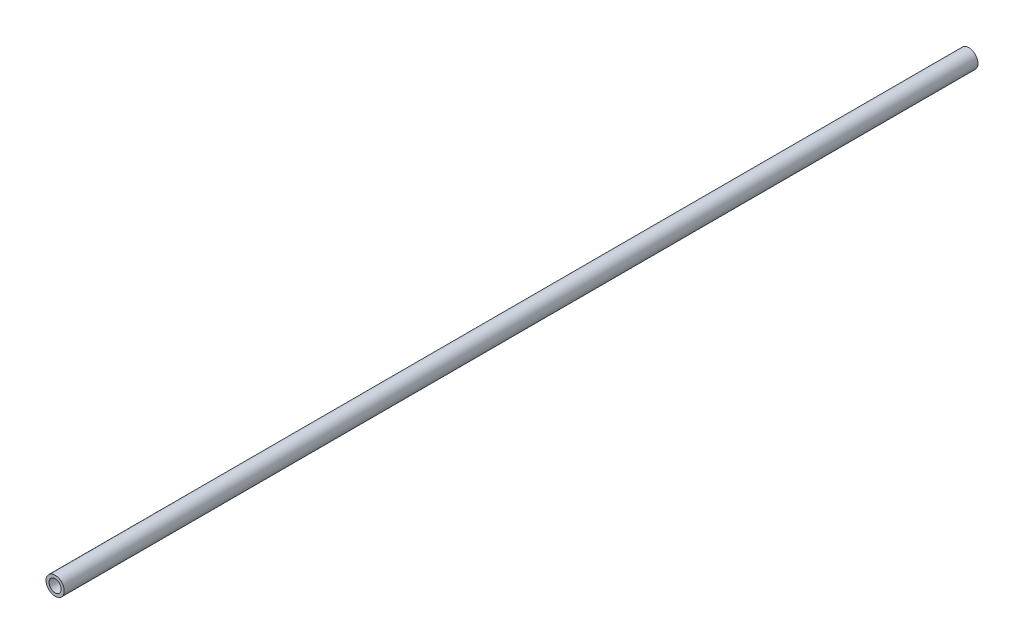
ISO-10303-21;
HEADER;
FILE_DESCRIPTION(('STEP AP214'),'2;1');
FILE_NAME('part.step','',(''),(''),'','','');
FILE_SCHEMA(('AUTOMOTIVE_DESIGN { 1 0 10303 214 1 1 1 1 }'));
ENDSEC;
DATA;
#1=APPLICATION_CONTEXT('core data for automotive mechanical design processes');
#2=APPLICATION_PROTOCOL_DEFINITION('international standard','automotive_design',2000,#1);
#3=PRODUCT_CONTEXT('',#1,'mechanical');
#4=PRODUCT('Part','Part','',(#3));
#5=PRODUCT_RELATED_PRODUCT_CATEGORY('part','',(#4));
#6=PRODUCT_DEFINITION_FORMATION('','',#4);
#7=PRODUCT_DEFINITION_CONTEXT('part definition',#1,'design');
#8=PRODUCT_DEFINITION('design','',#6,#7);
#9=PRODUCT_DEFINITION_SHAPE('','',#8);
#10=(LENGTH_UNIT() NAMED_UNIT(*) SI_UNIT(.MILLI.,.METRE.));
#11=(NAMED_UNIT(*) PLANE_ANGLE_UNIT() SI_UNIT($,.RADIAN.));
#12=(NAMED_UNIT(*) SI_UNIT($,.STERADIAN.) SOLID_ANGLE_UNIT());
#13=UNCERTAINTY_MEASURE_WITH_UNIT(LENGTH_MEASURE(1.E-05),#10,'distance_accuracy_value','');
#14=(GEOMETRIC_REPRESENTATION_CONTEXT(3) GLOBAL_UNCERTAINTY_ASSIGNED_CONTEXT((#13)) GLOBAL_UNIT_ASSIGNED_CONTEXT((#10,
#11,#12)) REPRESENTATION_CONTEXT('',''));
#15=CARTESIAN_POINT('',(0.,0.,0.));
#16=DIRECTION('',(0.,0.,1.));
#17=DIRECTION('',(1.,0.,0.));
#18=AXIS2_PLACEMENT_3D('',#15,#16,#17);
#19=CARTESIAN_POINT('',(0.,0.,762.));
#20=DIRECTION('',(0.,0.,1.));
#21=DIRECTION('',(1.,0.,0.));
#22=AXIS2_PLACEMENT_3D('',#19,#20,#21);
#23=PLANE('',#22);
#24=CARTESIAN_POINT('',(0.,0.,762.));
#25=DIRECTION('',(0.,0.,1.));
#26=DIRECTION('',(1.,0.,0.));
#27=AXIS2_PLACEMENT_3D('',#24,#25,#26);
#28=CIRCLE('',#27,7.62);
#29=CARTESIAN_POINT('',(7.62,0.,762.));
#30=VERTEX_POINT('',#29);
#31=EDGE_CURVE('E12',#30,#30,#28,.T.);
#32=ORIENTED_EDGE('',*,*,#31,.T.);
#33=EDGE_LOOP('',(#32));
#34=FACE_BOUND('',#33,.T.);
#35=CARTESIAN_POINT('',(0.,0.,762.));
#36=DIRECTION('',(0.,0.,1.));
#37=DIRECTION('',(1.,0.,0.));
#38=AXIS2_PLACEMENT_3D('',#35,#36,#37);
#39=CIRCLE('',#38,5.08);
#40=CARTESIAN_POINT('',(5.08,0.,762.));
#41=VERTEX_POINT('',#40);
#42=EDGE_CURVE('E52',#41,#41,#39,.T.);
#43=ORIENTED_EDGE('',*,*,#42,.F.);
#44=EDGE_LOOP('',(#43));
#45=FACE_BOUND('',#44,.T.);
#46=ADVANCED_FACE('F41',(#34,#45),#23,.T.);
#47=CARTESIAN_POINT('',(0.,0.,0.));
#48=DIRECTION('',(0.,0.,1.));
#49=DIRECTION('',(1.,0.,0.));
#50=AXIS2_PLACEMENT_3D('',#47,#48,#49);
#51=PLANE('',#50);
#52=CARTESIAN_POINT('',(0.,0.,0.));
#53=DIRECTION('',(0.,0.,1.));
#54=DIRECTION('',(1.,0.,0.));
#55=AXIS2_PLACEMENT_3D('',#52,#53,#54);
#56=CIRCLE('',#55,7.62);
#57=CARTESIAN_POINT('',(7.62,0.,0.));
#58=VERTEX_POINT('',#57);
#59=EDGE_CURVE('E45',#58,#58,#56,.T.);
#60=ORIENTED_EDGE('',*,*,#59,.F.);
#61=EDGE_LOOP('',(#60));
#62=FACE_BOUND('',#61,.T.);
#63=CARTESIAN_POINT('',(0.,0.,0.));
#64=DIRECTION('',(0.,0.,1.));
#65=DIRECTION('',(1.,0.,0.));
#66=AXIS2_PLACEMENT_3D('',#63,#64,#65);
#67=CIRCLE('',#66,5.08);
#68=CARTESIAN_POINT('',(5.08,0.,0.));
#69=VERTEX_POINT('',#68);
#70=EDGE_CURVE('E54',#69,#69,#67,.T.);
#71=ORIENTED_EDGE('',*,*,#70,.T.);
#72=EDGE_LOOP('',(#71));
#73=FACE_BOUND('',#72,.T.);
#74=ADVANCED_FACE('F64',(#62,#73),#51,.F.);
#75=CARTESIAN_POINT('',(0.,0.,762.));
#76=DIRECTION('',(0.,0.,-1.));
#77=DIRECTION('',(-1.,0.,0.));
#78=AXIS2_PLACEMENT_3D('',#75,#76,#77);
#79=CYLINDRICAL_SURFACE('',#78,7.62);
#80=ORIENTED_EDGE('',*,*,#31,.F.);
#81=EDGE_LOOP('',(#80));
#82=FACE_BOUND('',#81,.T.);
#83=ORIENTED_EDGE('',*,*,#59,.T.);
#84=EDGE_LOOP('',(#83));
#85=FACE_BOUND('',#84,.T.);
#86=ADVANCED_FACE('F43',(#82,#85),#79,.T.);
#87=CARTESIAN_POINT('',(0.,0.,762.));
#88=DIRECTION('',(0.,0.,-1.));
#89=DIRECTION('',(-1.,0.,0.));
#90=AXIS2_PLACEMENT_3D('',#87,#88,#89);
#91=CYLINDRICAL_SURFACE('',#90,5.08);
#92=ORIENTED_EDGE('',*,*,#42,.T.);
#93=EDGE_LOOP('',(#92));
#94=FACE_BOUND('',#93,.T.);
#95=ORIENTED_EDGE('',*,*,#70,.F.);
#96=EDGE_LOOP('',(#95));
#97=FACE_BOUND('',#96,.T.);
#98=ADVANCED_FACE('F60',(#94,#97),#91,.F.);
#99=CLOSED_SHELL('',(#46,#74,#86,#98));
#100=MANIFOLD_SOLID_BREP('B2',#99);
#101=ADVANCED_BREP_SHAPE_REPRESENTATION('',(#18,#100),#14);
#102=SHAPE_DEFINITION_REPRESENTATION(#9,#101);
ENDSEC;
END-ISO-10303-21;
